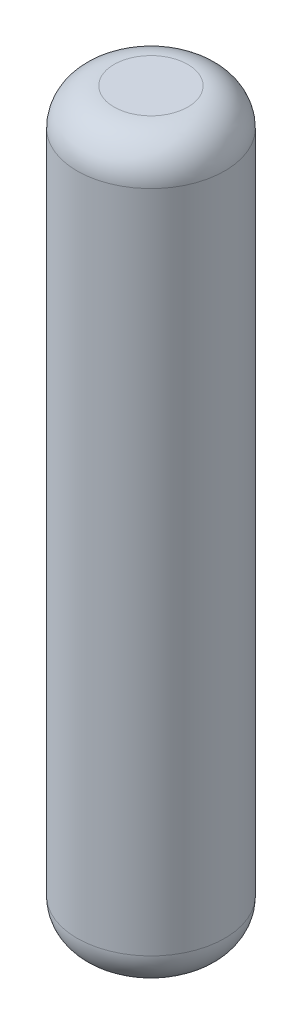
ISO-10303-21;
HEADER;
FILE_DESCRIPTION(('STEP AP214'),'2;1');
FILE_NAME('part.step','',(''),(''),'','','');
FILE_SCHEMA(('AUTOMOTIVE_DESIGN { 1 0 10303 214 1 1 1 1 }'));
ENDSEC;
DATA;
#1=APPLICATION_CONTEXT('core data for automotive mechanical design processes');
#2=APPLICATION_PROTOCOL_DEFINITION('international standard','automotive_design',2000,#1);
#3=PRODUCT_CONTEXT('',#1,'mechanical');
#4=PRODUCT('Part','Part','',(#3));
#5=PRODUCT_RELATED_PRODUCT_CATEGORY('part','',(#4));
#6=PRODUCT_DEFINITION_FORMATION('','',#4);
#7=PRODUCT_DEFINITION_CONTEXT('part definition',#1,'design');
#8=PRODUCT_DEFINITION('design','',#6,#7);
#9=PRODUCT_DEFINITION_SHAPE('','',#8);
#10=(LENGTH_UNIT() NAMED_UNIT(*) SI_UNIT(.MILLI.,.METRE.));
#11=(NAMED_UNIT(*) PLANE_ANGLE_UNIT() SI_UNIT($,.RADIAN.));
#12=(NAMED_UNIT(*) SI_UNIT($,.STERADIAN.) SOLID_ANGLE_UNIT());
#13=UNCERTAINTY_MEASURE_WITH_UNIT(LENGTH_MEASURE(1.E-05),#10,'distance_accuracy_value','');
#14=(GEOMETRIC_REPRESENTATION_CONTEXT(3) GLOBAL_UNCERTAINTY_ASSIGNED_CONTEXT((#13)) GLOBAL_UNIT_ASSIGNED_CONTEXT((#10,
#11,#12)) REPRESENTATION_CONTEXT('',''));
#15=CARTESIAN_POINT('',(0.,0.,0.));
#16=DIRECTION('',(0.,0.,1.));
#17=DIRECTION('',(1.,0.,0.));
#18=AXIS2_PLACEMENT_3D('',#15,#16,#17);
#19=CARTESIAN_POINT('',(0.,20.,0.));
#20=DIRECTION('',(0.,-1.,0.));
#21=DIRECTION('',(0.,0.,-1.));
#22=AXIS2_PLACEMENT_3D('',#19,#20,#21);
#23=CYLINDRICAL_SURFACE('',#22,2.);
#24=CARTESIAN_POINT('',(0.,1.,0.));
#25=DIRECTION('',(0.,1.,0.));
#26=DIRECTION('',(0.,0.,1.));
#27=AXIS2_PLACEMENT_3D('',#24,#25,#26);
#28=CIRCLE('',#27,2.);
#29=CARTESIAN_POINT('',(0.,1.,2.));
#30=VERTEX_POINT('',#29);
#31=EDGE_CURVE('E50',#30,#30,#28,.T.);
#32=ORIENTED_EDGE('',*,*,#31,.T.);
#33=EDGE_LOOP('',(#32));
#34=FACE_BOUND('',#33,.T.);
#35=CARTESIAN_POINT('',(0.,19.,0.));
#36=DIRECTION('',(0.,1.,0.));
#37=DIRECTION('',(0.,0.,1.));
#38=AXIS2_PLACEMENT_3D('',#35,#36,#37);
#39=CIRCLE('',#38,2.);
#40=CARTESIAN_POINT('',(0.,19.,2.));
#41=VERTEX_POINT('',#40);
#42=EDGE_CURVE('E55',#41,#41,#39,.F.);
#43=ORIENTED_EDGE('',*,*,#42,.T.);
#44=EDGE_LOOP('',(#43));
#45=FACE_BOUND('',#44,.T.);
#46=ADVANCED_FACE('F37',(#34,#45),#23,.T.);
#47=CARTESIAN_POINT('',(0.,20.,0.));
#48=DIRECTION('',(0.,1.,0.));
#49=DIRECTION('',(0.,0.,1.));
#50=AXIS2_PLACEMENT_3D('',#47,#48,#49);
#51=PLANE('',#50);
#52=CARTESIAN_POINT('',(0.,20.,0.));
#53=DIRECTION('',(0.,1.,0.));
#54=DIRECTION('',(0.,0.,1.));
#55=AXIS2_PLACEMENT_3D('',#52,#53,#54);
#56=CIRCLE('',#55,1.);
#57=CARTESIAN_POINT('',(0.,20.,1.));
#58=VERTEX_POINT('',#57);
#59=EDGE_CURVE('E10',#58,#58,#56,.T.);
#60=ORIENTED_EDGE('',*,*,#59,.T.);
#61=EDGE_LOOP('',(#60));
#62=FACE_BOUND('',#61,.T.);
#63=ADVANCED_FACE('F72',(#62),#51,.T.);
#64=CARTESIAN_POINT('',(0.,0.,0.));
#65=DIRECTION('',(0.,1.,0.));
#66=DIRECTION('',(0.,0.,1.));
#67=AXIS2_PLACEMENT_3D('',#64,#65,#66);
#68=PLANE('',#67);
#69=CARTESIAN_POINT('',(0.,0.,0.));
#70=DIRECTION('',(0.,1.,0.));
#71=DIRECTION('',(0.,0.,1.));
#72=AXIS2_PLACEMENT_3D('',#69,#70,#71);
#73=CIRCLE('',#72,1.);
#74=CARTESIAN_POINT('',(0.,0.,1.));
#75=VERTEX_POINT('',#74);
#76=EDGE_CURVE('E45',#75,#75,#73,.F.);
#77=ORIENTED_EDGE('',*,*,#76,.T.);
#78=EDGE_LOOP('',(#77));
#79=FACE_BOUND('',#78,.T.);
#80=ADVANCED_FACE('F69',(#79),#68,.F.);
#81=CARTESIAN_POINT('',(0.,1.,0.));
#82=DIRECTION('',(0.,1.,0.));
#83=DIRECTION('',(0.,0.,1.));
#84=AXIS2_PLACEMENT_3D('',#81,#82,#83);
#85=DEGENERATE_TOROIDAL_SURFACE('',#84,1.,1.,.T.);
#86=ORIENTED_EDGE('',*,*,#76,.F.);
#87=EDGE_LOOP('',(#86));
#88=FACE_BOUND('',#87,.T.);
#89=ORIENTED_EDGE('',*,*,#31,.F.);
#90=EDGE_LOOP('',(#89));
#91=FACE_BOUND('',#90,.T.);
#92=ADVANCED_FACE('F65',(#88,#91),#85,.T.);
#93=CARTESIAN_POINT('',(0.,19.,0.));
#94=DIRECTION('',(0.,1.,0.));
#95=DIRECTION('',(0.,0.,1.));
#96=AXIS2_PLACEMENT_3D('',#93,#94,#95);
#97=DEGENERATE_TOROIDAL_SURFACE('',#96,1.,1.,.T.);
#98=ORIENTED_EDGE('',*,*,#42,.F.);
#99=EDGE_LOOP('',(#98));
#100=FACE_BOUND('',#99,.T.);
#101=ORIENTED_EDGE('',*,*,#59,.F.);
#102=EDGE_LOOP('',(#101));
#103=FACE_BOUND('',#102,.T.);
#104=ADVANCED_FACE('F39',(#100,#103),#97,.T.);
#105=CLOSED_SHELL('',(#46,#63,#80,#92,#104));
#106=MANIFOLD_SOLID_BREP('B2',#105);
#107=ADVANCED_BREP_SHAPE_REPRESENTATION('',(#18,#106),#14);
#108=SHAPE_DEFINITION_REPRESENTATION(#9,#107);
ENDSEC;
END-ISO-10303-21;
